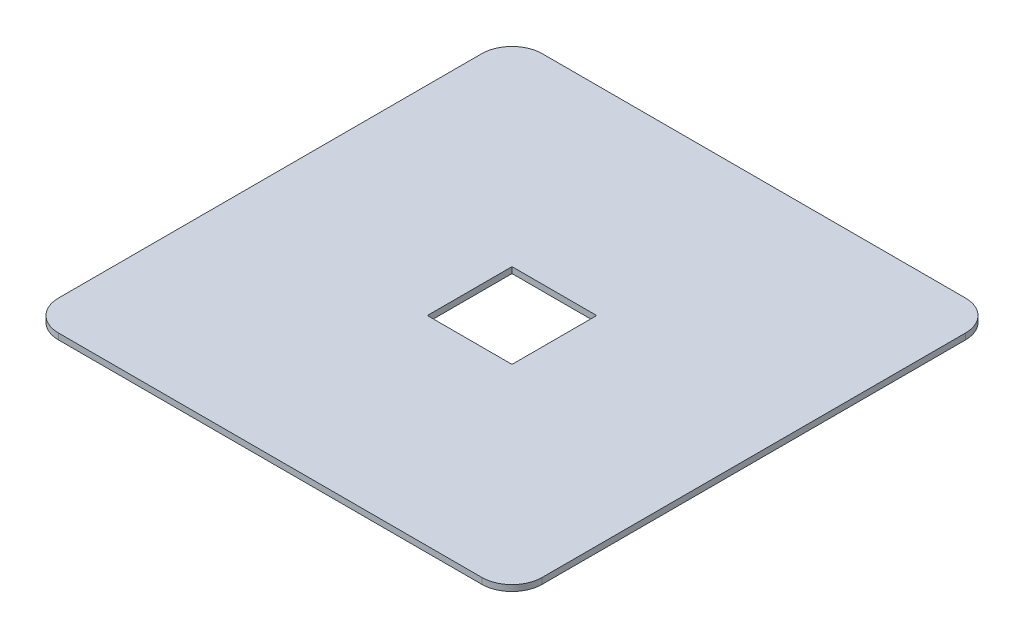
ISO-10303-21;
HEADER;
FILE_DESCRIPTION(('STEP AP214'),'2;1');
FILE_NAME('part.step','',(''),(''),'','','');
FILE_SCHEMA(('AUTOMOTIVE_DESIGN { 1 0 10303 214 1 1 1 1 }'));
ENDSEC;
DATA;
#1=APPLICATION_CONTEXT('core data for automotive mechanical design processes');
#2=APPLICATION_PROTOCOL_DEFINITION('international standard','automotive_design',2000,#1);
#3=PRODUCT_CONTEXT('',#1,'mechanical');
#4=PRODUCT('Part','Part','',(#3));
#5=PRODUCT_RELATED_PRODUCT_CATEGORY('part','',(#4));
#6=PRODUCT_DEFINITION_FORMATION('','',#4);
#7=PRODUCT_DEFINITION_CONTEXT('part definition',#1,'design');
#8=PRODUCT_DEFINITION('design','',#6,#7);
#9=PRODUCT_DEFINITION_SHAPE('','',#8);
#10=(LENGTH_UNIT() NAMED_UNIT(*) SI_UNIT(.MILLI.,.METRE.));
#11=(NAMED_UNIT(*) PLANE_ANGLE_UNIT() SI_UNIT($,.RADIAN.));
#12=(NAMED_UNIT(*) SI_UNIT($,.STERADIAN.) SOLID_ANGLE_UNIT());
#13=UNCERTAINTY_MEASURE_WITH_UNIT(LENGTH_MEASURE(1.E-05),#10,'distance_accuracy_value','');
#14=(GEOMETRIC_REPRESENTATION_CONTEXT(3) GLOBAL_UNCERTAINTY_ASSIGNED_CONTEXT((#13)) GLOBAL_UNIT_ASSIGNED_CONTEXT((#10,
#11,#12)) REPRESENTATION_CONTEXT('',''));
#15=CARTESIAN_POINT('',(0.,0.,0.));
#16=DIRECTION('',(0.,0.,1.));
#17=DIRECTION('',(1.,0.,0.));
#18=AXIS2_PLACEMENT_3D('',#15,#16,#17);
#19=CARTESIAN_POINT('',(0.,1.,0.));
#20=DIRECTION('',(1.,0.,0.));
#21=DIRECTION('',(0.,0.,-1.));
#22=AXIS2_PLACEMENT_3D('',#19,#20,#21);
#23=PLANE('',#22);
#24=DIRECTION('',(0.,0.,1.));
#25=VECTOR('',#24,1.);
#26=CARTESIAN_POINT('',(0.,1.,0.));
#27=LINE('',#26,#25);
#28=CARTESIAN_POINT('',(0.,1.,-75.));
#29=VERTEX_POINT('',#28);
#30=CARTESIAN_POINT('',(0.,1.,-5.));
#31=VERTEX_POINT('',#30);
#32=EDGE_CURVE('E157',#29,#31,#27,.T.);
#33=ORIENTED_EDGE('',*,*,#32,.F.);
#34=DIRECTION('',(0.,-1.,0.));
#35=VECTOR('',#34,1.);
#36=CARTESIAN_POINT('',(0.,1.,-75.));
#37=LINE('',#36,#35);
#38=CARTESIAN_POINT('',(0.,0.,-75.));
#39=VERTEX_POINT('',#38);
#40=EDGE_CURVE('E11',#29,#39,#37,.T.);
#41=ORIENTED_EDGE('',*,*,#40,.T.);
#42=DIRECTION('',(0.,0.,1.));
#43=VECTOR('',#42,1.);
#44=CARTESIAN_POINT('',(0.,0.,0.));
#45=LINE('',#44,#43);
#46=CARTESIAN_POINT('',(0.,0.,-5.));
#47=VERTEX_POINT('',#46);
#48=EDGE_CURVE('E153',#39,#47,#45,.T.);
#49=ORIENTED_EDGE('',*,*,#48,.T.);
#50=DIRECTION('',(0.,-1.,0.));
#51=VECTOR('',#50,1.);
#52=CARTESIAN_POINT('',(0.,1.,-5.));
#53=LINE('',#52,#51);
#54=EDGE_CURVE('E39',#47,#31,#53,.F.);
#55=ORIENTED_EDGE('',*,*,#54,.T.);
#56=EDGE_LOOP('',(#33,#41,#49,#55));
#57=FACE_BOUND('',#56,.T.);
#58=ADVANCED_FACE('F31',(#57),#23,.F.);
#59=CARTESIAN_POINT('',(0.,1.,0.));
#60=DIRECTION('',(0.,0.,-1.));
#61=DIRECTION('',(-1.,0.,0.));
#62=AXIS2_PLACEMENT_3D('',#59,#60,#61);
#63=PLANE('',#62);
#64=DIRECTION('',(1.,0.,0.));
#65=VECTOR('',#64,1.);
#66=CARTESIAN_POINT('',(0.,0.,0.));
#67=LINE('',#66,#65);
#68=CARTESIAN_POINT('',(5.,0.,0.));
#69=VERTEX_POINT('',#68);
#70=CARTESIAN_POINT('',(75.,0.,0.));
#71=VERTEX_POINT('',#70);
#72=EDGE_CURVE('E173',#69,#71,#67,.T.);
#73=ORIENTED_EDGE('',*,*,#72,.T.);
#74=DIRECTION('',(0.,-1.,0.));
#75=VECTOR('',#74,1.);
#76=CARTESIAN_POINT('',(75.,1.,0.));
#77=LINE('',#76,#75);
#78=CARTESIAN_POINT('',(75.,1.,0.));
#79=VERTEX_POINT('',#78);
#80=EDGE_CURVE('E196',#71,#79,#77,.F.);
#81=ORIENTED_EDGE('',*,*,#80,.T.);
#82=DIRECTION('',(1.,0.,0.));
#83=VECTOR('',#82,1.);
#84=CARTESIAN_POINT('',(0.,1.,0.));
#85=LINE('',#84,#83);
#86=CARTESIAN_POINT('',(5.,1.,0.));
#87=VERTEX_POINT('',#86);
#88=EDGE_CURVE('E160',#87,#79,#85,.T.);
#89=ORIENTED_EDGE('',*,*,#88,.F.);
#90=DIRECTION('',(0.,-1.,0.));
#91=VECTOR('',#90,1.);
#92=CARTESIAN_POINT('',(5.,1.,0.));
#93=LINE('',#92,#91);
#94=EDGE_CURVE('E193',#87,#69,#93,.T.);
#95=ORIENTED_EDGE('',*,*,#94,.T.);
#96=EDGE_LOOP('',(#73,#81,#89,#95));
#97=FACE_BOUND('',#96,.T.);
#98=ADVANCED_FACE('F224',(#97),#63,.F.);
#99=CARTESIAN_POINT('',(80.,1.,0.));
#100=DIRECTION('',(-1.,0.,0.));
#101=DIRECTION('',(0.,0.,1.));
#102=AXIS2_PLACEMENT_3D('',#99,#100,#101);
#103=PLANE('',#102);
#104=DIRECTION('',(0.,0.,-1.));
#105=VECTOR('',#104,1.);
#106=CARTESIAN_POINT('',(80.,1.,0.));
#107=LINE('',#106,#105);
#108=CARTESIAN_POINT('',(80.,1.,-5.));
#109=VERTEX_POINT('',#108);
#110=CARTESIAN_POINT('',(80.,1.,-75.));
#111=VERTEX_POINT('',#110);
#112=EDGE_CURVE('E164',#109,#111,#107,.T.);
#113=ORIENTED_EDGE('',*,*,#112,.F.);
#114=DIRECTION('',(0.,-1.,0.));
#115=VECTOR('',#114,1.);
#116=CARTESIAN_POINT('',(80.,1.,-5.));
#117=LINE('',#116,#115);
#118=CARTESIAN_POINT('',(80.,0.,-5.));
#119=VERTEX_POINT('',#118);
#120=EDGE_CURVE('E182',#109,#119,#117,.T.);
#121=ORIENTED_EDGE('',*,*,#120,.T.);
#122=DIRECTION('',(0.,0.,-1.));
#123=VECTOR('',#122,1.);
#124=CARTESIAN_POINT('',(80.,0.,0.));
#125=LINE('',#124,#123);
#126=CARTESIAN_POINT('',(80.,0.,-75.));
#127=VERTEX_POINT('',#126);
#128=EDGE_CURVE('E176',#119,#127,#125,.T.);
#129=ORIENTED_EDGE('',*,*,#128,.T.);
#130=DIRECTION('',(0.,-1.,0.));
#131=VECTOR('',#130,1.);
#132=CARTESIAN_POINT('',(80.,1.,-75.));
#133=LINE('',#132,#131);
#134=EDGE_CURVE('E170',#127,#111,#133,.F.);
#135=ORIENTED_EDGE('',*,*,#134,.T.);
#136=EDGE_LOOP('',(#113,#121,#129,#135));
#137=FACE_BOUND('',#136,.T.);
#138=ADVANCED_FACE('F233',(#137),#103,.F.);
#139=CARTESIAN_POINT('',(0.,1.,-80.));
#140=DIRECTION('',(0.,0.,1.));
#141=DIRECTION('',(1.,0.,0.));
#142=AXIS2_PLACEMENT_3D('',#139,#140,#141);
#143=PLANE('',#142);
#144=DIRECTION('',(-1.,0.,0.));
#145=VECTOR('',#144,1.);
#146=CARTESIAN_POINT('',(0.,1.,-80.));
#147=LINE('',#146,#145);
#148=CARTESIAN_POINT('',(75.,1.,-80.));
#149=VERTEX_POINT('',#148);
#150=CARTESIAN_POINT('',(4.99999999999999,1.,-80.));
#151=VERTEX_POINT('',#150);
#152=EDGE_CURVE('E167',#149,#151,#147,.T.);
#153=ORIENTED_EDGE('',*,*,#152,.F.);
#154=DIRECTION('',(0.,-1.,0.));
#155=VECTOR('',#154,1.);
#156=CARTESIAN_POINT('',(75.,1.,-80.));
#157=LINE('',#156,#155);
#158=CARTESIAN_POINT('',(75.,0.,-80.));
#159=VERTEX_POINT('',#158);
#160=EDGE_CURVE('E208',#149,#159,#157,.T.);
#161=ORIENTED_EDGE('',*,*,#160,.T.);
#162=DIRECTION('',(-1.,0.,0.));
#163=VECTOR('',#162,1.);
#164=CARTESIAN_POINT('',(0.,0.,-80.));
#165=LINE('',#164,#163);
#166=CARTESIAN_POINT('',(4.99999999999999,0.,-80.));
#167=VERTEX_POINT('',#166);
#168=EDGE_CURVE('E161',#159,#167,#165,.T.);
#169=ORIENTED_EDGE('',*,*,#168,.T.);
#170=DIRECTION('',(0.,-1.,0.));
#171=VECTOR('',#170,1.);
#172=CARTESIAN_POINT('',(4.99999999999999,1.,-80.));
#173=LINE('',#172,#171);
#174=EDGE_CURVE('E206',#167,#151,#173,.F.);
#175=ORIENTED_EDGE('',*,*,#174,.T.);
#176=EDGE_LOOP('',(#153,#161,#169,#175));
#177=FACE_BOUND('',#176,.T.);
#178=ADVANCED_FACE('F242',(#177),#143,.F.);
#179=CARTESIAN_POINT('',(0.,1.,-80.));
#180=DIRECTION('',(0.,-1.,0.));
#181=DIRECTION('',(0.,0.,-1.));
#182=AXIS2_PLACEMENT_3D('',#179,#180,#181);
#183=PLANE('',#182);
#184=DIRECTION('',(1.,0.,0.));
#185=VECTOR('',#184,1.);
#186=CARTESIAN_POINT('',(33.,1.,-33.));
#187=LINE('',#186,#185);
#188=CARTESIAN_POINT('',(33.,1.,-33.));
#189=VERTEX_POINT('',#188);
#190=CARTESIAN_POINT('',(47.,1.,-33.));
#191=VERTEX_POINT('',#190);
#192=EDGE_CURVE('E147',#189,#191,#187,.T.);
#193=ORIENTED_EDGE('',*,*,#192,.F.);
#194=DIRECTION('',(0.,0.,1.));
#195=VECTOR('',#194,1.);
#196=CARTESIAN_POINT('',(33.,1.,-47.));
#197=LINE('',#196,#195);
#198=CARTESIAN_POINT('',(33.,1.,-47.));
#199=VERTEX_POINT('',#198);
#200=EDGE_CURVE('E46',#199,#189,#197,.T.);
#201=ORIENTED_EDGE('',*,*,#200,.F.);
#202=DIRECTION('',(-1.,0.,0.));
#203=VECTOR('',#202,1.);
#204=CARTESIAN_POINT('',(33.,1.,-47.));
#205=LINE('',#204,#203);
#206=CARTESIAN_POINT('',(47.,1.,-47.));
#207=VERTEX_POINT('',#206);
#208=EDGE_CURVE('E138',#207,#199,#205,.T.);
#209=ORIENTED_EDGE('',*,*,#208,.F.);
#210=DIRECTION('',(0.,0.,-1.));
#211=VECTOR('',#210,1.);
#212=CARTESIAN_POINT('',(47.,1.,-47.));
#213=LINE('',#212,#211);
#214=EDGE_CURVE('E141',#191,#207,#213,.T.);
#215=ORIENTED_EDGE('',*,*,#214,.F.);
#216=EDGE_LOOP('',(#193,#201,#209,#215));
#217=FACE_BOUND('',#216,.T.);
#218=ORIENTED_EDGE('',*,*,#88,.T.);
#219=CARTESIAN_POINT('',(75.,1.,-5.));
#220=DIRECTION('',(0.,-1.,0.));
#221=DIRECTION('',(0.,0.,-1.));
#222=AXIS2_PLACEMENT_3D('',#219,#220,#221);
#223=CIRCLE('',#222,5.);
#224=EDGE_CURVE('E204',#79,#109,#223,.F.);
#225=ORIENTED_EDGE('',*,*,#224,.T.);
#226=ORIENTED_EDGE('',*,*,#112,.T.);
#227=CARTESIAN_POINT('',(75.,1.,-75.));
#228=DIRECTION('',(0.,-1.,0.));
#229=DIRECTION('',(0.,0.,-1.));
#230=AXIS2_PLACEMENT_3D('',#227,#228,#229);
#231=CIRCLE('',#230,5.);
#232=EDGE_CURVE('E202',#111,#149,#231,.F.);
#233=ORIENTED_EDGE('',*,*,#232,.T.);
#234=ORIENTED_EDGE('',*,*,#152,.T.);
#235=CARTESIAN_POINT('',(4.99999999999999,1.,-75.));
#236=DIRECTION('',(0.,-1.,0.));
#237=DIRECTION('',(0.,0.,-1.));
#238=AXIS2_PLACEMENT_3D('',#235,#236,#237);
#239=CIRCLE('',#238,5.);
#240=EDGE_CURVE('E200',#151,#29,#239,.F.);
#241=ORIENTED_EDGE('',*,*,#240,.T.);
#242=ORIENTED_EDGE('',*,*,#32,.T.);
#243=CARTESIAN_POINT('',(5.,1.,-5.));
#244=DIRECTION('',(0.,-1.,0.));
#245=DIRECTION('',(0.,0.,-1.));
#246=AXIS2_PLACEMENT_3D('',#243,#244,#245);
#247=CIRCLE('',#246,5.);
#248=EDGE_CURVE('E198',#31,#87,#247,.F.);
#249=ORIENTED_EDGE('',*,*,#248,.T.);
#250=EDGE_LOOP('',(#218,#225,#226,#233,#234,#241,#242,#249));
#251=FACE_BOUND('',#250,.T.);
#252=ADVANCED_FACE('F218',(#217,#251),#183,.F.);
#253=CARTESIAN_POINT('',(0.,0.,-80.));
#254=DIRECTION('',(0.,-1.,0.));
#255=DIRECTION('',(0.,0.,-1.));
#256=AXIS2_PLACEMENT_3D('',#253,#254,#255);
#257=PLANE('',#256);
#258=DIRECTION('',(0.,0.,1.));
#259=VECTOR('',#258,1.);
#260=CARTESIAN_POINT('',(33.,0.,-47.));
#261=LINE('',#260,#259);
#262=CARTESIAN_POINT('',(33.,0.,-47.));
#263=VERTEX_POINT('',#262);
#264=CARTESIAN_POINT('',(33.,0.,-33.));
#265=VERTEX_POINT('',#264);
#266=EDGE_CURVE('E122',#263,#265,#261,.T.);
#267=ORIENTED_EDGE('',*,*,#266,.T.);
#268=DIRECTION('',(1.,0.,0.));
#269=VECTOR('',#268,1.);
#270=CARTESIAN_POINT('',(33.,0.,-33.));
#271=LINE('',#270,#269);
#272=CARTESIAN_POINT('',(47.,0.,-33.));
#273=VERTEX_POINT('',#272);
#274=EDGE_CURVE('E131',#265,#273,#271,.T.);
#275=ORIENTED_EDGE('',*,*,#274,.T.);
#276=DIRECTION('',(0.,0.,-1.));
#277=VECTOR('',#276,1.);
#278=CARTESIAN_POINT('',(47.,0.,-47.));
#279=LINE('',#278,#277);
#280=CARTESIAN_POINT('',(47.,0.,-47.));
#281=VERTEX_POINT('',#280);
#282=EDGE_CURVE('E54',#273,#281,#279,.T.);
#283=ORIENTED_EDGE('',*,*,#282,.T.);
#284=DIRECTION('',(-1.,0.,0.));
#285=VECTOR('',#284,1.);
#286=CARTESIAN_POINT('',(33.,0.,-47.));
#287=LINE('',#286,#285);
#288=EDGE_CURVE('E128',#281,#263,#287,.T.);
#289=ORIENTED_EDGE('',*,*,#288,.T.);
#290=EDGE_LOOP('',(#267,#275,#283,#289));
#291=FACE_BOUND('',#290,.T.);
#292=ORIENTED_EDGE('',*,*,#128,.F.);
#293=CARTESIAN_POINT('',(75.,0.,-5.));
#294=DIRECTION('',(0.,-1.,0.));
#295=DIRECTION('',(0.,0.,-1.));
#296=AXIS2_PLACEMENT_3D('',#293,#294,#295);
#297=CIRCLE('',#296,5.);
#298=EDGE_CURVE('E191',#119,#71,#297,.T.);
#299=ORIENTED_EDGE('',*,*,#298,.T.);
#300=ORIENTED_EDGE('',*,*,#72,.F.);
#301=CARTESIAN_POINT('',(5.,0.,-5.));
#302=DIRECTION('',(0.,-1.,0.));
#303=DIRECTION('',(0.,0.,-1.));
#304=AXIS2_PLACEMENT_3D('',#301,#302,#303);
#305=CIRCLE('',#304,5.);
#306=EDGE_CURVE('E185',#69,#47,#305,.T.);
#307=ORIENTED_EDGE('',*,*,#306,.T.);
#308=ORIENTED_EDGE('',*,*,#48,.F.);
#309=CARTESIAN_POINT('',(4.99999999999999,0.,-75.));
#310=DIRECTION('',(0.,-1.,0.));
#311=DIRECTION('',(0.,0.,-1.));
#312=AXIS2_PLACEMENT_3D('',#309,#310,#311);
#313=CIRCLE('',#312,5.);
#314=EDGE_CURVE('E187',#39,#167,#313,.T.);
#315=ORIENTED_EDGE('',*,*,#314,.T.);
#316=ORIENTED_EDGE('',*,*,#168,.F.);
#317=CARTESIAN_POINT('',(75.,0.,-75.));
#318=DIRECTION('',(0.,-1.,0.));
#319=DIRECTION('',(0.,0.,-1.));
#320=AXIS2_PLACEMENT_3D('',#317,#318,#319);
#321=CIRCLE('',#320,5.);
#322=EDGE_CURVE('E189',#159,#127,#321,.T.);
#323=ORIENTED_EDGE('',*,*,#322,.T.);
#324=EDGE_LOOP('',(#292,#299,#300,#307,#308,#315,#316,#323));
#325=FACE_BOUND('',#324,.T.);
#326=ADVANCED_FACE('F135',(#291,#325),#257,.T.);
#327=CARTESIAN_POINT('',(75.,1.,-5.));
#328=DIRECTION('',(0.,-1.,0.));
#329=DIRECTION('',(0.,0.,-1.));
#330=AXIS2_PLACEMENT_3D('',#327,#328,#329);
#331=CYLINDRICAL_SURFACE('',#330,5.);
#332=ORIENTED_EDGE('',*,*,#224,.F.);
#333=ORIENTED_EDGE('',*,*,#80,.F.);
#334=ORIENTED_EDGE('',*,*,#298,.F.);
#335=ORIENTED_EDGE('',*,*,#120,.F.);
#336=EDGE_LOOP('',(#332,#333,#334,#335));
#337=FACE_BOUND('',#336,.T.);
#338=ADVANCED_FACE('F230',(#337),#331,.T.);
#339=CARTESIAN_POINT('',(75.,1.,-75.));
#340=DIRECTION('',(0.,-1.,0.));
#341=DIRECTION('',(0.,0.,-1.));
#342=AXIS2_PLACEMENT_3D('',#339,#340,#341);
#343=CYLINDRICAL_SURFACE('',#342,5.);
#344=ORIENTED_EDGE('',*,*,#232,.F.);
#345=ORIENTED_EDGE('',*,*,#134,.F.);
#346=ORIENTED_EDGE('',*,*,#322,.F.);
#347=ORIENTED_EDGE('',*,*,#160,.F.);
#348=EDGE_LOOP('',(#344,#345,#346,#347));
#349=FACE_BOUND('',#348,.T.);
#350=ADVANCED_FACE('F239',(#349),#343,.T.);
#351=CARTESIAN_POINT('',(4.99999999999999,1.,-75.));
#352=DIRECTION('',(0.,-1.,0.));
#353=DIRECTION('',(0.,0.,-1.));
#354=AXIS2_PLACEMENT_3D('',#351,#352,#353);
#355=CYLINDRICAL_SURFACE('',#354,5.);
#356=ORIENTED_EDGE('',*,*,#240,.F.);
#357=ORIENTED_EDGE('',*,*,#174,.F.);
#358=ORIENTED_EDGE('',*,*,#314,.F.);
#359=ORIENTED_EDGE('',*,*,#40,.F.);
#360=EDGE_LOOP('',(#356,#357,#358,#359));
#361=FACE_BOUND('',#360,.T.);
#362=ADVANCED_FACE('F245',(#361),#355,.T.);
#363=CARTESIAN_POINT('',(5.,1.,-5.));
#364=DIRECTION('',(0.,-1.,0.));
#365=DIRECTION('',(0.,0.,-1.));
#366=AXIS2_PLACEMENT_3D('',#363,#364,#365);
#367=CYLINDRICAL_SURFACE('',#366,5.);
#368=ORIENTED_EDGE('',*,*,#248,.F.);
#369=ORIENTED_EDGE('',*,*,#54,.F.);
#370=ORIENTED_EDGE('',*,*,#306,.F.);
#371=ORIENTED_EDGE('',*,*,#94,.F.);
#372=EDGE_LOOP('',(#368,#369,#370,#371));
#373=FACE_BOUND('',#372,.T.);
#374=ADVANCED_FACE('F33',(#373),#367,.T.);
#375=CARTESIAN_POINT('',(33.,0.,-47.));
#376=DIRECTION('',(-1.,0.,0.));
#377=DIRECTION('',(0.,0.,1.));
#378=AXIS2_PLACEMENT_3D('',#375,#376,#377);
#379=PLANE('',#378);
#380=ORIENTED_EDGE('',*,*,#200,.T.);
#381=DIRECTION('',(0.,1.,0.));
#382=VECTOR('',#381,1.);
#383=CARTESIAN_POINT('',(33.,0.,-33.));
#384=LINE('',#383,#382);
#385=EDGE_CURVE('E118',#265,#189,#384,.T.);
#386=ORIENTED_EDGE('',*,*,#385,.F.);
#387=ORIENTED_EDGE('',*,*,#266,.F.);
#388=DIRECTION('',(0.,1.,0.));
#389=VECTOR('',#388,1.);
#390=CARTESIAN_POINT('',(33.,0.,-47.));
#391=LINE('',#390,#389);
#392=EDGE_CURVE('E151',#263,#199,#391,.T.);
#393=ORIENTED_EDGE('',*,*,#392,.T.);
#394=EDGE_LOOP('',(#380,#386,#387,#393));
#395=FACE_BOUND('',#394,.T.);
#396=ADVANCED_FACE('F120',(#395),#379,.F.);
#397=CARTESIAN_POINT('',(33.,0.,-47.));
#398=DIRECTION('',(0.,0.,-1.));
#399=DIRECTION('',(-1.,0.,0.));
#400=AXIS2_PLACEMENT_3D('',#397,#398,#399);
#401=PLANE('',#400);
#402=ORIENTED_EDGE('',*,*,#208,.T.);
#403=ORIENTED_EDGE('',*,*,#392,.F.);
#404=ORIENTED_EDGE('',*,*,#288,.F.);
#405=DIRECTION('',(0.,1.,0.));
#406=VECTOR('',#405,1.);
#407=CARTESIAN_POINT('',(47.,0.,-47.));
#408=LINE('',#407,#406);
#409=EDGE_CURVE('E154',#281,#207,#408,.T.);
#410=ORIENTED_EDGE('',*,*,#409,.T.);
#411=EDGE_LOOP('',(#402,#403,#404,#410));
#412=FACE_BOUND('',#411,.T.);
#413=ADVANCED_FACE('F303',(#412),#401,.F.);
#414=CARTESIAN_POINT('',(47.,0.,-47.));
#415=DIRECTION('',(1.,0.,0.));
#416=DIRECTION('',(0.,0.,-1.));
#417=AXIS2_PLACEMENT_3D('',#414,#415,#416);
#418=PLANE('',#417);
#419=ORIENTED_EDGE('',*,*,#214,.T.);
#420=ORIENTED_EDGE('',*,*,#409,.F.);
#421=ORIENTED_EDGE('',*,*,#282,.F.);
#422=DIRECTION('',(0.,1.,0.));
#423=VECTOR('',#422,1.);
#424=CARTESIAN_POINT('',(47.,0.,-33.));
#425=LINE('',#424,#423);
#426=EDGE_CURVE('E127',#273,#191,#425,.T.);
#427=ORIENTED_EDGE('',*,*,#426,.T.);
#428=EDGE_LOOP('',(#419,#420,#421,#427));
#429=FACE_BOUND('',#428,.T.);
#430=ADVANCED_FACE('F311',(#429),#418,.F.);
#431=CARTESIAN_POINT('',(33.,0.,-33.));
#432=DIRECTION('',(0.,0.,1.));
#433=DIRECTION('',(1.,0.,0.));
#434=AXIS2_PLACEMENT_3D('',#431,#432,#433);
#435=PLANE('',#434);
#436=ORIENTED_EDGE('',*,*,#192,.T.);
#437=ORIENTED_EDGE('',*,*,#426,.F.);
#438=ORIENTED_EDGE('',*,*,#274,.F.);
#439=ORIENTED_EDGE('',*,*,#385,.T.);
#440=EDGE_LOOP('',(#436,#437,#438,#439));
#441=FACE_BOUND('',#440,.T.);
#442=ADVANCED_FACE('F132',(#441),#435,.F.);
#443=CLOSED_SHELL('',(#58,#98,#138,#178,#252,#326,#338,#350,#362,#374,#396,#413,#430,#442));
#444=MANIFOLD_SOLID_BREP('B2',#443);
#445=ADVANCED_BREP_SHAPE_REPRESENTATION('',(#18,#444),#14);
#446=SHAPE_DEFINITION_REPRESENTATION(#9,#445);
ENDSEC;
END-ISO-10303-21;
